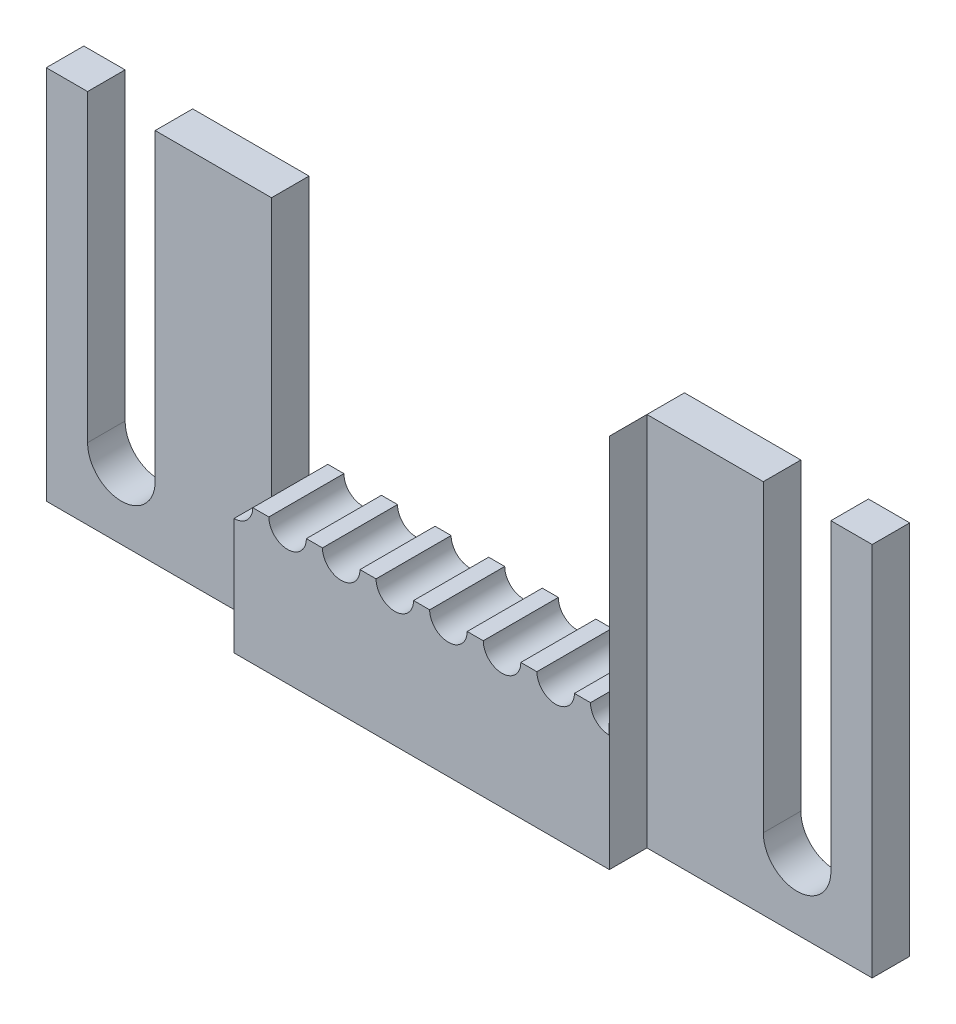
ISO-10303-21;
HEADER;
FILE_DESCRIPTION(('STEP AP214'),'2;1');
FILE_NAME('part.step','',(''),(''),'','','');
FILE_SCHEMA(('AUTOMOTIVE_DESIGN { 1 0 10303 214 1 1 1 1 }'));
ENDSEC;
DATA;
#1=APPLICATION_CONTEXT('core data for automotive mechanical design processes');
#2=APPLICATION_PROTOCOL_DEFINITION('international standard','automotive_design',2000,#1);
#3=PRODUCT_CONTEXT('',#1,'mechanical');
#4=PRODUCT('Part','Part','',(#3));
#5=PRODUCT_RELATED_PRODUCT_CATEGORY('part','',(#4));
#6=PRODUCT_DEFINITION_FORMATION('','',#4);
#7=PRODUCT_DEFINITION_CONTEXT('part definition',#1,'design');
#8=PRODUCT_DEFINITION('design','',#6,#7);
#9=PRODUCT_DEFINITION_SHAPE('','',#8);
#10=(LENGTH_UNIT() NAMED_UNIT(*) SI_UNIT(.MILLI.,.METRE.));
#11=(NAMED_UNIT(*) PLANE_ANGLE_UNIT() SI_UNIT($,.RADIAN.));
#12=(NAMED_UNIT(*) SI_UNIT($,.STERADIAN.) SOLID_ANGLE_UNIT());
#13=UNCERTAINTY_MEASURE_WITH_UNIT(LENGTH_MEASURE(1.E-05),#10,'distance_accuracy_value','');
#14=(GEOMETRIC_REPRESENTATION_CONTEXT(3) GLOBAL_UNCERTAINTY_ASSIGNED_CONTEXT((#13)) GLOBAL_UNIT_ASSIGNED_CONTEXT((#10,
#11,#12)) REPRESENTATION_CONTEXT('',''));
#15=CARTESIAN_POINT('',(0.,0.,0.));
#16=DIRECTION('',(0.,0.,1.));
#17=DIRECTION('',(1.,0.,0.));
#18=AXIS2_PLACEMENT_3D('',#15,#16,#17);
#19=CARTESIAN_POINT('',(-27.5,12.5,5.));
#20=DIRECTION('',(0.,-1.,0.));
#21=DIRECTION('',(0.,0.,-1.));
#22=AXIS2_PLACEMENT_3D('',#19,#20,#21);
#23=PLANE('',#22);
#24=DIRECTION('',(-1.,0.,0.));
#25=VECTOR('',#24,1.);
#26=CARTESIAN_POINT('',(0.,12.5,2.5));
#27=LINE('',#26,#25);
#28=CARTESIAN_POINT('',(20.25,12.5,2.5));
#29=VERTEX_POINT('',#28);
#30=CARTESIAN_POINT('',(12.5,12.5,2.5));
#31=VERTEX_POINT('',#30);
#32=EDGE_CURVE('E807',#29,#31,#27,.T.);
#33=ORIENTED_EDGE('',*,*,#32,.F.);
#34=DIRECTION('',(0.,0.,-1.));
#35=VECTOR('',#34,1.);
#36=CARTESIAN_POINT('',(20.25,12.5,5.));
#37=LINE('',#36,#35);
#38=CARTESIAN_POINT('',(20.25,12.5,0.));
#39=VERTEX_POINT('',#38);
#40=EDGE_CURVE('E13',#29,#39,#37,.T.);
#41=ORIENTED_EDGE('',*,*,#40,.T.);
#42=DIRECTION('',(-1.,0.,0.));
#43=VECTOR('',#42,1.);
#44=CARTESIAN_POINT('',(-27.5,12.5,0.));
#45=LINE('',#44,#43);
#46=CARTESIAN_POINT('',(12.5,12.5,0.));
#47=VERTEX_POINT('',#46);
#48=EDGE_CURVE('E901',#39,#47,#45,.T.);
#49=ORIENTED_EDGE('',*,*,#48,.T.);
#50=DIRECTION('',(0.,0.,1.));
#51=VECTOR('',#50,1.);
#52=CARTESIAN_POINT('',(12.5,12.5,-5.));
#53=LINE('',#52,#51);
#54=EDGE_CURVE('E837',#47,#31,#53,.T.);
#55=ORIENTED_EDGE('',*,*,#54,.T.);
#56=EDGE_LOOP('',(#33,#41,#49,#55));
#57=FACE_BOUND('',#56,.T.);
#58=ADVANCED_FACE('F523',(#57),#23,.F.);
#59=DIRECTION('',(-1.,0.,0.));
#60=VECTOR('',#59,1.);
#61=CARTESIAN_POINT('',(0.,12.5,2.5));
#62=LINE('',#61,#60);
#63=CARTESIAN_POINT('',(-24.75,12.5,2.5));
#64=VERTEX_POINT('',#63);
#65=CARTESIAN_POINT('',(-27.5,12.5,2.5));
#66=VERTEX_POINT('',#65);
#67=EDGE_CURVE('E790',#64,#66,#62,.T.);
#68=ORIENTED_EDGE('',*,*,#67,.F.);
#69=DIRECTION('',(0.,0.,-1.));
#70=VECTOR('',#69,1.);
#71=CARTESIAN_POINT('',(-24.75,12.5,5.));
#72=LINE('',#71,#70);
#73=CARTESIAN_POINT('',(-24.75,12.5,0.));
#74=VERTEX_POINT('',#73);
#75=EDGE_CURVE('E969',#64,#74,#72,.T.);
#76=ORIENTED_EDGE('',*,*,#75,.T.);
#77=CARTESIAN_POINT('',(-27.5,12.5,0.));
#78=VERTEX_POINT('',#77);
#79=EDGE_CURVE('E897',#74,#78,#45,.T.);
#80=ORIENTED_EDGE('',*,*,#79,.T.);
#81=DIRECTION('',(0.,0.,-1.));
#82=VECTOR('',#81,1.);
#83=CARTESIAN_POINT('',(-27.5,12.5,5.));
#84=LINE('',#83,#82);
#85=EDGE_CURVE('E910',#66,#78,#84,.T.);
#86=ORIENTED_EDGE('',*,*,#85,.F.);
#87=EDGE_LOOP('',(#68,#76,#80,#86));
#88=FACE_BOUND('',#87,.T.);
#89=ADVANCED_FACE('F998',(#88),#23,.F.);
#90=CARTESIAN_POINT('',(-12.5,12.5,0.));
#91=VERTEX_POINT('',#90);
#92=CARTESIAN_POINT('',(-20.25,12.5,0.));
#93=VERTEX_POINT('',#92);
#94=EDGE_CURVE('E902',#91,#93,#45,.T.);
#95=ORIENTED_EDGE('',*,*,#94,.T.);
#96=DIRECTION('',(0.,0.,1.));
#97=VECTOR('',#96,1.);
#98=CARTESIAN_POINT('',(-20.25,12.5,5.));
#99=LINE('',#98,#97);
#100=CARTESIAN_POINT('',(-20.25,12.5,2.5));
#101=VERTEX_POINT('',#100);
#102=EDGE_CURVE('E967',#93,#101,#99,.T.);
#103=ORIENTED_EDGE('',*,*,#102,.T.);
#104=CARTESIAN_POINT('',(-12.5,12.5,2.5));
#105=VERTEX_POINT('',#104);
#106=EDGE_CURVE('E791',#105,#101,#62,.T.);
#107=ORIENTED_EDGE('',*,*,#106,.F.);
#108=DIRECTION('',(0.,0.,1.));
#109=VECTOR('',#108,1.);
#110=CARTESIAN_POINT('',(-12.5,12.5,-5.));
#111=LINE('',#110,#109);
#112=EDGE_CURVE('E873',#91,#105,#111,.T.);
#113=ORIENTED_EDGE('',*,*,#112,.F.);
#114=EDGE_LOOP('',(#95,#103,#107,#113));
#115=FACE_BOUND('',#114,.T.);
#116=ADVANCED_FACE('F1046',(#115),#23,.F.);
#117=CARTESIAN_POINT('',(-27.5,12.5,5.));
#118=DIRECTION('',(1.,0.,0.));
#119=DIRECTION('',(0.,0.,-1.));
#120=AXIS2_PLACEMENT_3D('',#117,#118,#119);
#121=PLANE('',#120);
#122=DIRECTION('',(0.,-1.,0.));
#123=VECTOR('',#122,1.);
#124=CARTESIAN_POINT('',(-27.5,0.,2.5));
#125=LINE('',#124,#123);
#126=CARTESIAN_POINT('',(-27.5,-12.5,2.5));
#127=VERTEX_POINT('',#126);
#128=EDGE_CURVE('E794',#66,#127,#125,.T.);
#129=ORIENTED_EDGE('',*,*,#128,.F.);
#130=ORIENTED_EDGE('',*,*,#85,.T.);
#131=DIRECTION('',(0.,-1.,0.));
#132=VECTOR('',#131,1.);
#133=CARTESIAN_POINT('',(-27.5,12.5,0.));
#134=LINE('',#133,#132);
#135=CARTESIAN_POINT('',(-27.5,-12.5,0.));
#136=VERTEX_POINT('',#135);
#137=EDGE_CURVE('E900',#78,#136,#134,.T.);
#138=ORIENTED_EDGE('',*,*,#137,.T.);
#139=DIRECTION('',(0.,0.,-1.));
#140=VECTOR('',#139,1.);
#141=CARTESIAN_POINT('',(-27.5,-12.5,5.));
#142=LINE('',#141,#140);
#143=EDGE_CURVE('E908',#127,#136,#142,.T.);
#144=ORIENTED_EDGE('',*,*,#143,.F.);
#145=EDGE_LOOP('',(#129,#130,#138,#144));
#146=FACE_BOUND('',#145,.T.);
#147=ADVANCED_FACE('F994',(#146),#121,.F.);
#148=CARTESIAN_POINT('',(-12.5,0.,-5.));
#149=DIRECTION('',(-1.,0.,0.));
#150=DIRECTION('',(0.,-1.,0.));
#151=AXIS2_PLACEMENT_3D('',#148,#149,#150);
#152=PLANE('',#151);
#153=DIRECTION('',(0.,1.,0.));
#154=VECTOR('',#153,1.);
#155=CARTESIAN_POINT('',(-12.5,0.,2.5));
#156=LINE('',#155,#154);
#157=CARTESIAN_POINT('',(-12.5,-4.74999999999999,2.5));
#158=VERTEX_POINT('',#157);
#159=EDGE_CURVE('E965',#158,#105,#156,.T.);
#160=ORIENTED_EDGE('',*,*,#159,.F.);
#161=DIRECTION('',(0.,0.,1.));
#162=VECTOR('',#161,1.);
#163=CARTESIAN_POINT('',(-12.5,-4.74999999999999,-5.));
#164=LINE('',#163,#162);
#165=CARTESIAN_POINT('',(-12.5,-4.74999999999999,0.));
#166=VERTEX_POINT('',#165);
#167=EDGE_CURVE('E869',#166,#158,#164,.T.);
#168=ORIENTED_EDGE('',*,*,#167,.F.);
#169=DIRECTION('',(0.,-1.,0.));
#170=VECTOR('',#169,1.);
#171=CARTESIAN_POINT('',(-12.5,0.,0.));
#172=LINE('',#171,#170);
#173=EDGE_CURVE('E951',#91,#166,#172,.T.);
#174=ORIENTED_EDGE('',*,*,#173,.F.);
#175=ORIENTED_EDGE('',*,*,#112,.T.);
#176=EDGE_LOOP('',(#160,#168,#174,#175));
#177=FACE_BOUND('',#176,.T.);
#178=ADVANCED_FACE('F1040',(#177),#152,.F.);
#179=CARTESIAN_POINT('',(27.5,12.5,0.));
#180=VERTEX_POINT('',#179);
#181=CARTESIAN_POINT('',(24.75,12.5,0.));
#182=VERTEX_POINT('',#181);
#183=EDGE_CURVE('E898',#180,#182,#45,.T.);
#184=ORIENTED_EDGE('',*,*,#183,.T.);
#185=DIRECTION('',(0.,0.,1.));
#186=VECTOR('',#185,1.);
#187=CARTESIAN_POINT('',(24.75,12.5,5.));
#188=LINE('',#187,#186);
#189=CARTESIAN_POINT('',(24.75,12.5,2.5));
#190=VERTEX_POINT('',#189);
#191=EDGE_CURVE('E531',#182,#190,#188,.T.);
#192=ORIENTED_EDGE('',*,*,#191,.T.);
#193=CARTESIAN_POINT('',(27.5,12.5,2.5));
#194=VERTEX_POINT('',#193);
#195=EDGE_CURVE('E808',#194,#190,#27,.T.);
#196=ORIENTED_EDGE('',*,*,#195,.F.);
#197=DIRECTION('',(0.,0.,-1.));
#198=VECTOR('',#197,1.);
#199=CARTESIAN_POINT('',(27.5,12.5,5.));
#200=LINE('',#199,#198);
#201=EDGE_CURVE('E913',#194,#180,#200,.T.);
#202=ORIENTED_EDGE('',*,*,#201,.T.);
#203=EDGE_LOOP('',(#184,#192,#196,#202));
#204=FACE_BOUND('',#203,.T.);
#205=ADVANCED_FACE('F973',(#204),#23,.F.);
#206=CARTESIAN_POINT('',(0.,0.,5.));
#207=DIRECTION('',(0.,0.,1.));
#208=DIRECTION('',(1.,0.,0.));
#209=AXIS2_PLACEMENT_3D('',#206,#207,#208);
#210=PLANE('',#209);
#211=DIRECTION('',(0.,1.,0.));
#212=VECTOR('',#211,1.);
#213=CARTESIAN_POINT('',(-12.5,0.,5.));
#214=LINE('',#213,#212);
#215=CARTESIAN_POINT('',(-12.5,-12.5,5.));
#216=VERTEX_POINT('',#215);
#217=CARTESIAN_POINT('',(-12.5,-4.74999999999999,5.));
#218=VERTEX_POINT('',#217);
#219=EDGE_CURVE('E784',#216,#218,#214,.T.);
#220=ORIENTED_EDGE('',*,*,#219,.F.);
#221=DIRECTION('',(1.,0.,0.));
#222=VECTOR('',#221,1.);
#223=CARTESIAN_POINT('',(-27.5,-12.5,5.));
#224=LINE('',#223,#222);
#225=CARTESIAN_POINT('',(12.5,-12.5,5.));
#226=VERTEX_POINT('',#225);
#227=EDGE_CURVE('E891',#216,#226,#224,.T.);
#228=ORIENTED_EDGE('',*,*,#227,.T.);
#229=DIRECTION('',(0.,1.,0.));
#230=VECTOR('',#229,1.);
#231=CARTESIAN_POINT('',(12.5,0.,5.));
#232=LINE('',#231,#230);
#233=CARTESIAN_POINT('',(12.5,12.5,5.));
#234=VERTEX_POINT('',#233);
#235=EDGE_CURVE('E799',#226,#234,#232,.T.);
#236=ORIENTED_EDGE('',*,*,#235,.T.);
#237=DIRECTION('',(-0.000579710047518429,-0.999999831968116,0.));
#238=VECTOR('',#237,1.);
#239=CARTESIAN_POINT('',(12.4927494248269,-0.0072421735796183,5.));
#240=LINE('',#239,#238);
#241=CARTESIAN_POINT('',(12.49,-4.74999999999999,5.));
#242=VERTEX_POINT('',#241);
#243=EDGE_CURVE('E819',#234,#242,#240,.T.);
#244=ORIENTED_EDGE('',*,*,#243,.T.);
#245=CARTESIAN_POINT('',(12.49,-3.49999999999999,5.));
#246=DIRECTION('',(0.,0.,1.));
#247=DIRECTION('',(1.,0.,0.));
#248=AXIS2_PLACEMENT_3D('',#245,#246,#247);
#249=CIRCLE('',#248,1.25);
#250=CARTESIAN_POINT('',(11.24,-3.49999999999999,5.));
#251=VERTEX_POINT('',#250);
#252=EDGE_CURVE('E834',#251,#242,#249,.T.);
#253=ORIENTED_EDGE('',*,*,#252,.F.);
#254=DIRECTION('',(1.,0.,0.));
#255=VECTOR('',#254,1.);
#256=CARTESIAN_POINT('',(0.,-3.49999999999999,5.));
#257=LINE('',#256,#255);
#258=CARTESIAN_POINT('',(10.17,-3.49999999999999,5.));
#259=VERTEX_POINT('',#258);
#260=EDGE_CURVE('E830',#259,#251,#257,.T.);
#261=ORIENTED_EDGE('',*,*,#260,.F.);
#262=CARTESIAN_POINT('',(8.91999999999999,-3.49999999999999,5.));
#263=DIRECTION('',(0.,0.,1.));
#264=DIRECTION('',(1.,0.,0.));
#265=AXIS2_PLACEMENT_3D('',#262,#263,#264);
#266=CIRCLE('',#265,1.25);
#267=CARTESIAN_POINT('',(7.66999999999999,-3.49999999999999,5.));
#268=VERTEX_POINT('',#267);
#269=EDGE_CURVE('E816',#268,#259,#266,.T.);
#270=ORIENTED_EDGE('',*,*,#269,.F.);
#271=CARTESIAN_POINT('',(6.59999999999999,-3.49999999999999,5.));
#272=VERTEX_POINT('',#271);
#273=EDGE_CURVE('E1020',#272,#268,#257,.T.);
#274=ORIENTED_EDGE('',*,*,#273,.F.);
#275=CARTESIAN_POINT('',(5.34999999999999,-3.49999999999999,5.));
#276=DIRECTION('',(0.,0.,1.));
#277=DIRECTION('',(1.,0.,0.));
#278=AXIS2_PLACEMENT_3D('',#275,#276,#277);
#279=CIRCLE('',#278,1.25);
#280=CARTESIAN_POINT('',(4.09999999999999,-3.49999999999999,5.));
#281=VERTEX_POINT('',#280);
#282=EDGE_CURVE('E886',#281,#272,#279,.T.);
#283=ORIENTED_EDGE('',*,*,#282,.F.);
#284=CARTESIAN_POINT('',(3.02999999999999,-3.49999999999999,5.));
#285=VERTEX_POINT('',#284);
#286=EDGE_CURVE('E1391',#285,#281,#257,.T.);
#287=ORIENTED_EDGE('',*,*,#286,.F.);
#288=CARTESIAN_POINT('',(1.77999999999999,-3.49999999999999,5.));
#289=DIRECTION('',(0.,0.,1.));
#290=DIRECTION('',(1.,0.,0.));
#291=AXIS2_PLACEMENT_3D('',#288,#289,#290);
#292=CIRCLE('',#291,1.25);
#293=CARTESIAN_POINT('',(0.529999999999994,-3.49999999999999,5.));
#294=VERTEX_POINT('',#293);
#295=EDGE_CURVE('E883',#294,#285,#292,.T.);
#296=ORIENTED_EDGE('',*,*,#295,.F.);
#297=CARTESIAN_POINT('',(-0.540000000000004,-3.49999999999999,5.));
#298=VERTEX_POINT('',#297);
#299=EDGE_CURVE('E1387',#298,#294,#257,.T.);
#300=ORIENTED_EDGE('',*,*,#299,.F.);
#301=CARTESIAN_POINT('',(-1.79000000000001,-3.49999999999999,5.));
#302=DIRECTION('',(0.,0.,1.));
#303=DIRECTION('',(1.,0.,0.));
#304=AXIS2_PLACEMENT_3D('',#301,#302,#303);
#305=CIRCLE('',#304,1.25);
#306=CARTESIAN_POINT('',(-3.04000000000001,-3.49999999999999,5.));
#307=VERTEX_POINT('',#306);
#308=EDGE_CURVE('E880',#307,#298,#305,.T.);
#309=ORIENTED_EDGE('',*,*,#308,.F.);
#310=CARTESIAN_POINT('',(-4.11,-3.49999999999999,5.));
#311=VERTEX_POINT('',#310);
#312=EDGE_CURVE('E1385',#311,#307,#257,.T.);
#313=ORIENTED_EDGE('',*,*,#312,.F.);
#314=CARTESIAN_POINT('',(-5.36,-3.49999999999999,5.));
#315=DIRECTION('',(0.,0.,1.));
#316=DIRECTION('',(1.,0.,0.));
#317=AXIS2_PLACEMENT_3D('',#314,#315,#316);
#318=CIRCLE('',#317,1.25);
#319=CARTESIAN_POINT('',(-6.61,-3.49999999999999,5.));
#320=VERTEX_POINT('',#319);
#321=EDGE_CURVE('E823',#320,#311,#318,.T.);
#322=ORIENTED_EDGE('',*,*,#321,.F.);
#323=CARTESIAN_POINT('',(-7.68,-3.49999999999999,5.));
#324=VERTEX_POINT('',#323);
#325=EDGE_CURVE('E831',#324,#320,#257,.T.);
#326=ORIENTED_EDGE('',*,*,#325,.F.);
#327=CARTESIAN_POINT('',(-8.93,-3.49999999999999,5.));
#328=DIRECTION('',(0.,0.,1.));
#329=DIRECTION('',(1.,0.,0.));
#330=AXIS2_PLACEMENT_3D('',#327,#328,#329);
#331=CIRCLE('',#330,1.25);
#332=CARTESIAN_POINT('',(-10.18,-3.49999999999999,5.));
#333=VERTEX_POINT('',#332);
#334=EDGE_CURVE('E829',#333,#324,#331,.T.);
#335=ORIENTED_EDGE('',*,*,#334,.F.);
#336=CARTESIAN_POINT('',(-11.25,-3.49999999999999,5.));
#337=VERTEX_POINT('',#336);
#338=EDGE_CURVE('E826',#337,#333,#257,.T.);
#339=ORIENTED_EDGE('',*,*,#338,.F.);
#340=CARTESIAN_POINT('',(-12.5,-3.49999999999999,5.));
#341=DIRECTION('',(0.,0.,1.));
#342=DIRECTION('',(1.,0.,0.));
#343=AXIS2_PLACEMENT_3D('',#340,#341,#342);
#344=CIRCLE('',#343,1.25);
#345=EDGE_CURVE('E822',#218,#337,#344,.T.);
#346=ORIENTED_EDGE('',*,*,#345,.F.);
#347=EDGE_LOOP('',(#220,#228,#236,#244,#253,#261,#270,#274,#283,#287,#296,#300,#309,#313,#322,
#326,#335,#339,#346));
#348=FACE_BOUND('',#347,.T.);
#349=ADVANCED_FACE('F1022',(#348),#210,.T.);
#350=CARTESIAN_POINT('',(27.5,12.5,5.));
#351=DIRECTION('',(-1.,0.,0.));
#352=DIRECTION('',(0.,-1.,0.));
#353=AXIS2_PLACEMENT_3D('',#350,#351,#352);
#354=PLANE('',#353);
#355=DIRECTION('',(0.,1.,0.));
#356=VECTOR('',#355,1.);
#357=CARTESIAN_POINT('',(27.5,0.,2.5));
#358=LINE('',#357,#356);
#359=CARTESIAN_POINT('',(27.5,-12.5,2.5));
#360=VERTEX_POINT('',#359);
#361=EDGE_CURVE('E805',#360,#194,#358,.T.);
#362=ORIENTED_EDGE('',*,*,#361,.F.);
#363=DIRECTION('',(0.,0.,-1.));
#364=VECTOR('',#363,1.);
#365=CARTESIAN_POINT('',(27.5,-12.5,5.));
#366=LINE('',#365,#364);
#367=CARTESIAN_POINT('',(27.5,-12.5,0.));
#368=VERTEX_POINT('',#367);
#369=EDGE_CURVE('E893',#360,#368,#366,.T.);
#370=ORIENTED_EDGE('',*,*,#369,.T.);
#371=DIRECTION('',(0.,1.,0.));
#372=VECTOR('',#371,1.);
#373=CARTESIAN_POINT('',(27.5,12.5,0.));
#374=LINE('',#373,#372);
#375=EDGE_CURVE('E840',#368,#180,#374,.T.);
#376=ORIENTED_EDGE('',*,*,#375,.T.);
#377=ORIENTED_EDGE('',*,*,#201,.F.);
#378=EDGE_LOOP('',(#362,#370,#376,#377));
#379=FACE_BOUND('',#378,.T.);
#380=ADVANCED_FACE('F525',(#379),#354,.F.);
#381=CARTESIAN_POINT('',(-27.5,-12.5,5.));
#382=DIRECTION('',(0.,1.,0.));
#383=DIRECTION('',(0.,0.,1.));
#384=AXIS2_PLACEMENT_3D('',#381,#382,#383);
#385=PLANE('',#384);
#386=ORIENTED_EDGE('',*,*,#227,.F.);
#387=DIRECTION('',(0.,0.,1.));
#388=VECTOR('',#387,1.);
#389=CARTESIAN_POINT('',(-12.5,-12.5,2.5));
#390=LINE('',#389,#388);
#391=CARTESIAN_POINT('',(-12.5,-12.5,2.5));
#392=VERTEX_POINT('',#391);
#393=EDGE_CURVE('E796',#392,#216,#390,.T.);
#394=ORIENTED_EDGE('',*,*,#393,.F.);
#395=DIRECTION('',(1.,0.,0.));
#396=VECTOR('',#395,1.);
#397=CARTESIAN_POINT('',(0.,-12.5,2.5));
#398=LINE('',#397,#396);
#399=EDGE_CURVE('E785',#127,#392,#398,.T.);
#400=ORIENTED_EDGE('',*,*,#399,.F.);
#401=ORIENTED_EDGE('',*,*,#143,.T.);
#402=DIRECTION('',(1.,0.,0.));
#403=VECTOR('',#402,1.);
#404=CARTESIAN_POINT('',(-27.5,-12.5,0.));
#405=LINE('',#404,#403);
#406=EDGE_CURVE('E894',#136,#368,#405,.T.);
#407=ORIENTED_EDGE('',*,*,#406,.T.);
#408=ORIENTED_EDGE('',*,*,#369,.F.);
#409=DIRECTION('',(1.,0.,0.));
#410=VECTOR('',#409,1.);
#411=CARTESIAN_POINT('',(0.,-12.5,2.5));
#412=LINE('',#411,#410);
#413=CARTESIAN_POINT('',(12.5,-12.5,2.5));
#414=VERTEX_POINT('',#413);
#415=EDGE_CURVE('E803',#414,#360,#412,.T.);
#416=ORIENTED_EDGE('',*,*,#415,.F.);
#417=DIRECTION('',(0.,0.,1.));
#418=VECTOR('',#417,1.);
#419=CARTESIAN_POINT('',(12.5,-12.5,2.5));
#420=LINE('',#419,#418);
#421=EDGE_CURVE('E811',#414,#226,#420,.T.);
#422=ORIENTED_EDGE('',*,*,#421,.T.);
#423=EDGE_LOOP('',(#386,#394,#400,#401,#407,#408,#416,#422));
#424=FACE_BOUND('',#423,.T.);
#425=ADVANCED_FACE('F984',(#424),#385,.F.);
#426=CARTESIAN_POINT('',(0.,0.,0.));
#427=DIRECTION('',(0.,0.,1.));
#428=DIRECTION('',(1.,0.,0.));
#429=AXIS2_PLACEMENT_3D('',#426,#427,#428);
#430=PLANE('',#429);
#431=ORIENTED_EDGE('',*,*,#48,.F.);
#432=DIRECTION('',(0.,1.,0.));
#433=VECTOR('',#432,1.);
#434=CARTESIAN_POINT('',(20.25,-7.75,0.));
#435=LINE('',#434,#433);
#436=CARTESIAN_POINT('',(20.25,-7.75,0.));
#437=VERTEX_POINT('',#436);
#438=EDGE_CURVE('E746',#437,#39,#435,.T.);
#439=ORIENTED_EDGE('',*,*,#438,.F.);
#440=CARTESIAN_POINT('',(22.5,-7.75,0.));
#441=DIRECTION('',(0.,0.,1.));
#442=DIRECTION('',(1.,0.,0.));
#443=AXIS2_PLACEMENT_3D('',#440,#441,#442);
#444=CIRCLE('',#443,2.24999999999999);
#445=CARTESIAN_POINT('',(24.75,-7.75,0.));
#446=VERTEX_POINT('',#445);
#447=EDGE_CURVE('E752',#437,#446,#444,.T.);
#448=ORIENTED_EDGE('',*,*,#447,.T.);
#449=DIRECTION('',(0.,1.,0.));
#450=VECTOR('',#449,1.);
#451=CARTESIAN_POINT('',(24.75,-7.75,0.));
#452=LINE('',#451,#450);
#453=EDGE_CURVE('E738',#446,#182,#452,.T.);
#454=ORIENTED_EDGE('',*,*,#453,.T.);
#455=ORIENTED_EDGE('',*,*,#183,.F.);
#456=ORIENTED_EDGE('',*,*,#375,.F.);
#457=ORIENTED_EDGE('',*,*,#406,.F.);
#458=ORIENTED_EDGE('',*,*,#137,.F.);
#459=ORIENTED_EDGE('',*,*,#79,.F.);
#460=DIRECTION('',(0.,1.,0.));
#461=VECTOR('',#460,1.);
#462=CARTESIAN_POINT('',(-24.75,-7.75,0.));
#463=LINE('',#462,#461);
#464=CARTESIAN_POINT('',(-24.75,-7.75,0.));
#465=VERTEX_POINT('',#464);
#466=EDGE_CURVE('E769',#465,#74,#463,.T.);
#467=ORIENTED_EDGE('',*,*,#466,.F.);
#468=CARTESIAN_POINT('',(-22.5,-7.75,0.));
#469=DIRECTION('',(0.,0.,1.));
#470=DIRECTION('',(1.,0.,0.));
#471=AXIS2_PLACEMENT_3D('',#468,#469,#470);
#472=CIRCLE('',#471,2.24999999999999);
#473=CARTESIAN_POINT('',(-20.25,-7.75,0.));
#474=VERTEX_POINT('',#473);
#475=EDGE_CURVE('E779',#465,#474,#472,.T.);
#476=ORIENTED_EDGE('',*,*,#475,.T.);
#477=DIRECTION('',(0.,1.,0.));
#478=VECTOR('',#477,1.);
#479=CARTESIAN_POINT('',(-20.25,-7.75,0.));
#480=LINE('',#479,#478);
#481=EDGE_CURVE('E766',#474,#93,#480,.T.);
#482=ORIENTED_EDGE('',*,*,#481,.T.);
#483=ORIENTED_EDGE('',*,*,#94,.F.);
#484=ORIENTED_EDGE('',*,*,#173,.T.);
#485=CARTESIAN_POINT('',(-12.5,-3.49999999999999,0.));
#486=DIRECTION('',(0.,0.,1.));
#487=DIRECTION('',(1.,0.,0.));
#488=AXIS2_PLACEMENT_3D('',#485,#486,#487);
#489=CIRCLE('',#488,1.25);
#490=CARTESIAN_POINT('',(-11.25,-3.49999999999999,0.));
#491=VERTEX_POINT('',#490);
#492=EDGE_CURVE('E942',#166,#491,#489,.T.);
#493=ORIENTED_EDGE('',*,*,#492,.T.);
#494=DIRECTION('',(1.,0.,0.));
#495=VECTOR('',#494,1.);
#496=CARTESIAN_POINT('',(0.,-3.49999999999999,0.));
#497=LINE('',#496,#495);
#498=CARTESIAN_POINT('',(-10.18,-3.49999999999999,0.));
#499=VERTEX_POINT('',#498);
#500=EDGE_CURVE('E933',#491,#499,#497,.T.);
#501=ORIENTED_EDGE('',*,*,#500,.T.);
#502=CARTESIAN_POINT('',(-8.93,-3.49999999999999,0.));
#503=DIRECTION('',(0.,0.,1.));
#504=DIRECTION('',(1.,0.,0.));
#505=AXIS2_PLACEMENT_3D('',#502,#503,#504);
#506=CIRCLE('',#505,1.25);
#507=CARTESIAN_POINT('',(-7.68,-3.49999999999999,0.));
#508=VERTEX_POINT('',#507);
#509=EDGE_CURVE('E924',#499,#508,#506,.T.);
#510=ORIENTED_EDGE('',*,*,#509,.T.);
#511=DIRECTION('',(1.,0.,0.));
#512=VECTOR('',#511,1.);
#513=CARTESIAN_POINT('',(0.,-3.49999999999999,0.));
#514=LINE('',#513,#512);
#515=CARTESIAN_POINT('',(-6.61,-3.49999999999999,0.));
#516=VERTEX_POINT('',#515);
#517=EDGE_CURVE('E918',#508,#516,#514,.T.);
#518=ORIENTED_EDGE('',*,*,#517,.T.);
#519=CARTESIAN_POINT('',(-5.36,-3.49999999999999,0.));
#520=DIRECTION('',(0.,0.,1.));
#521=DIRECTION('',(1.,0.,0.));
#522=AXIS2_PLACEMENT_3D('',#519,#520,#521);
#523=CIRCLE('',#522,1.25);
#524=CARTESIAN_POINT('',(-4.11,-3.49999999999999,0.));
#525=VERTEX_POINT('',#524);
#526=EDGE_CURVE('E915',#516,#525,#523,.T.);
#527=ORIENTED_EDGE('',*,*,#526,.T.);
#528=DIRECTION('',(1.,0.,0.));
#529=VECTOR('',#528,1.);
#530=CARTESIAN_POINT('',(0.,-3.49999999999999,0.));
#531=LINE('',#530,#529);
#532=CARTESIAN_POINT('',(-3.04000000000001,-3.49999999999999,0.));
#533=VERTEX_POINT('',#532);
#534=EDGE_CURVE('E921',#525,#533,#531,.T.);
#535=ORIENTED_EDGE('',*,*,#534,.T.);
#536=CARTESIAN_POINT('',(-1.79000000000001,-3.49999999999999,0.));
#537=DIRECTION('',(0.,0.,1.));
#538=DIRECTION('',(1.,0.,0.));
#539=AXIS2_PLACEMENT_3D('',#536,#537,#538);
#540=CIRCLE('',#539,1.25);
#541=CARTESIAN_POINT('',(-0.540000000000004,-3.49999999999999,0.));
#542=VERTEX_POINT('',#541);
#543=EDGE_CURVE('E927',#533,#542,#540,.T.);
#544=ORIENTED_EDGE('',*,*,#543,.T.);
#545=DIRECTION('',(1.,0.,0.));
#546=VECTOR('',#545,1.);
#547=CARTESIAN_POINT('',(0.,-3.49999999999999,0.));
#548=LINE('',#547,#546);
#549=CARTESIAN_POINT('',(0.529999999999994,-3.49999999999999,0.));
#550=VERTEX_POINT('',#549);
#551=EDGE_CURVE('E930',#542,#550,#548,.T.);
#552=ORIENTED_EDGE('',*,*,#551,.T.);
#553=CARTESIAN_POINT('',(1.77999999999999,-3.49999999999999,0.));
#554=DIRECTION('',(0.,0.,1.));
#555=DIRECTION('',(1.,0.,0.));
#556=AXIS2_PLACEMENT_3D('',#553,#554,#555);
#557=CIRCLE('',#556,1.25);
#558=CARTESIAN_POINT('',(3.02999999999999,-3.49999999999999,0.));
#559=VERTEX_POINT('',#558);
#560=EDGE_CURVE('E936',#550,#559,#557,.T.);
#561=ORIENTED_EDGE('',*,*,#560,.T.);
#562=DIRECTION('',(1.,0.,0.));
#563=VECTOR('',#562,1.);
#564=CARTESIAN_POINT('',(0.,-3.49999999999999,0.));
#565=LINE('',#564,#563);
#566=CARTESIAN_POINT('',(4.09999999999999,-3.49999999999999,0.));
#567=VERTEX_POINT('',#566);
#568=EDGE_CURVE('E939',#559,#567,#565,.T.);
#569=ORIENTED_EDGE('',*,*,#568,.T.);
#570=CARTESIAN_POINT('',(5.34999999999999,-3.49999999999999,0.));
#571=DIRECTION('',(0.,0.,1.));
#572=DIRECTION('',(1.,0.,0.));
#573=AXIS2_PLACEMENT_3D('',#570,#571,#572);
#574=CIRCLE('',#573,1.25);
#575=CARTESIAN_POINT('',(6.59999999999999,-3.49999999999999,0.));
#576=VERTEX_POINT('',#575);
#577=EDGE_CURVE('E945',#567,#576,#574,.T.);
#578=ORIENTED_EDGE('',*,*,#577,.T.);
#579=DIRECTION('',(1.,0.,0.));
#580=VECTOR('',#579,1.);
#581=CARTESIAN_POINT('',(0.,-3.49999999999999,0.));
#582=LINE('',#581,#580);
#583=CARTESIAN_POINT('',(7.66999999999999,-3.49999999999999,0.));
#584=VERTEX_POINT('',#583);
#585=EDGE_CURVE('E948',#576,#584,#582,.T.);
#586=ORIENTED_EDGE('',*,*,#585,.T.);
#587=CARTESIAN_POINT('',(8.91999999999999,-3.49999999999999,0.));
#588=DIRECTION('',(0.,0.,1.));
#589=DIRECTION('',(1.,0.,0.));
#590=AXIS2_PLACEMENT_3D('',#587,#588,#589);
#591=CIRCLE('',#590,1.25);
#592=CARTESIAN_POINT('',(10.17,-3.49999999999999,0.));
#593=VERTEX_POINT('',#592);
#594=EDGE_CURVE('E954',#584,#593,#591,.T.);
#595=ORIENTED_EDGE('',*,*,#594,.T.);
#596=DIRECTION('',(1.,0.,0.));
#597=VECTOR('',#596,1.);
#598=CARTESIAN_POINT('',(0.,-3.49999999999999,0.));
#599=LINE('',#598,#597);
#600=CARTESIAN_POINT('',(11.24,-3.49999999999999,0.));
#601=VERTEX_POINT('',#600);
#602=EDGE_CURVE('E957',#593,#601,#599,.T.);
#603=ORIENTED_EDGE('',*,*,#602,.T.);
#604=CARTESIAN_POINT('',(12.49,-3.49999999999999,0.));
#605=DIRECTION('',(0.,0.,1.));
#606=DIRECTION('',(1.,0.,0.));
#607=AXIS2_PLACEMENT_3D('',#604,#605,#606);
#608=CIRCLE('',#607,1.25);
#609=CARTESIAN_POINT('',(12.49,-4.74999999999999,0.));
#610=VERTEX_POINT('',#609);
#611=EDGE_CURVE('E960',#601,#610,#608,.T.);
#612=ORIENTED_EDGE('',*,*,#611,.T.);
#613=DIRECTION('',(-0.000579710047518429,-0.999999831968116,0.));
#614=VECTOR('',#613,1.);
#615=CARTESIAN_POINT('',(12.4927494248269,-0.0072421735796183,0.));
#616=LINE('',#615,#614);
#617=EDGE_CURVE('E963',#47,#610,#616,.T.);
#618=ORIENTED_EDGE('',*,*,#617,.F.);
#619=EDGE_LOOP('',(#431,#439,#448,#454,#455,#456,#457,#458,#459,#467,#476,#482,#483,#484,#493,
#501,#510,#518,#527,#535,#544,#552,#561,#569,#578,#586,#595,#603,#612,#618));
#620=FACE_BOUND('',#619,.T.);
#621=ADVANCED_FACE('F759',(#620),#430,.F.);
#622=CARTESIAN_POINT('',(-8.93,-3.49999999999999,-5.));
#623=DIRECTION('',(0.,0.,1.));
#624=DIRECTION('',(1.,0.,0.));
#625=AXIS2_PLACEMENT_3D('',#622,#623,#624);
#626=CYLINDRICAL_SURFACE('',#625,1.25);
#627=DIRECTION('',(0.,0.,1.));
#628=VECTOR('',#627,1.);
#629=CARTESIAN_POINT('',(-10.18,-3.49999999999999,-5.));
#630=LINE('',#629,#628);
#631=EDGE_CURVE('E865',#499,#333,#630,.T.);
#632=ORIENTED_EDGE('',*,*,#631,.T.);
#633=ORIENTED_EDGE('',*,*,#334,.T.);
#634=DIRECTION('',(0.,0.,1.));
#635=VECTOR('',#634,1.);
#636=CARTESIAN_POINT('',(-7.68,-3.49999999999999,-5.));
#637=LINE('',#636,#635);
#638=EDGE_CURVE('E863',#508,#324,#637,.T.);
#639=ORIENTED_EDGE('',*,*,#638,.F.);
#640=ORIENTED_EDGE('',*,*,#509,.F.);
#641=EDGE_LOOP('',(#632,#633,#639,#640));
#642=FACE_BOUND('',#641,.T.);
#643=ADVANCED_FACE('F1111',(#642),#626,.F.);
#644=CARTESIAN_POINT('',(0.,-3.49999999999999,-5.));
#645=DIRECTION('',(0.,-1.,0.));
#646=DIRECTION('',(0.,0.,-1.));
#647=AXIS2_PLACEMENT_3D('',#644,#645,#646);
#648=PLANE('',#647);
#649=DIRECTION('',(0.,0.,1.));
#650=VECTOR('',#649,1.);
#651=CARTESIAN_POINT('',(-11.25,-3.49999999999999,-5.));
#652=LINE('',#651,#650);
#653=EDGE_CURVE('E867',#491,#337,#652,.T.);
#654=ORIENTED_EDGE('',*,*,#653,.T.);
#655=ORIENTED_EDGE('',*,*,#338,.T.);
#656=ORIENTED_EDGE('',*,*,#631,.F.);
#657=ORIENTED_EDGE('',*,*,#500,.F.);
#658=EDGE_LOOP('',(#654,#655,#656,#657));
#659=FACE_BOUND('',#658,.T.);
#660=ADVANCED_FACE('F1179',(#659),#648,.F.);
#661=CARTESIAN_POINT('',(-12.5,-3.49999999999999,-5.));
#662=DIRECTION('',(0.,0.,1.));
#663=DIRECTION('',(1.,0.,0.));
#664=AXIS2_PLACEMENT_3D('',#661,#662,#663);
#665=CYLINDRICAL_SURFACE('',#664,1.25);
#666=ORIENTED_EDGE('',*,*,#167,.T.);
#667=EDGE_CURVE('E872',#158,#218,#164,.T.);
#668=ORIENTED_EDGE('',*,*,#667,.T.);
#669=ORIENTED_EDGE('',*,*,#345,.T.);
#670=ORIENTED_EDGE('',*,*,#653,.F.);
#671=ORIENTED_EDGE('',*,*,#492,.F.);
#672=EDGE_LOOP('',(#666,#668,#669,#670,#671));
#673=FACE_BOUND('',#672,.T.);
#674=ADVANCED_FACE('F1036',(#673),#665,.F.);
#675=CARTESIAN_POINT('',(12.4927494248269,-0.0072421735796183,-5.));
#676=DIRECTION('',(-0.999999831968116,0.000579710047518429,0.));
#677=DIRECTION('',(-0.000579710047518429,-0.999999831968116,0.));
#678=AXIS2_PLACEMENT_3D('',#675,#676,#677);
#679=PLANE('',#678);
#680=ORIENTED_EDGE('',*,*,#617,.T.);
#681=DIRECTION('',(0.,0.,1.));
#682=VECTOR('',#681,1.);
#683=CARTESIAN_POINT('',(12.49,-4.74999999999999,-5.));
#684=LINE('',#683,#682);
#685=EDGE_CURVE('E838',#610,#242,#684,.T.);
#686=ORIENTED_EDGE('',*,*,#685,.T.);
#687=ORIENTED_EDGE('',*,*,#243,.F.);
#688=DIRECTION('',(0.,0.,1.));
#689=VECTOR('',#688,1.);
#690=CARTESIAN_POINT('',(12.5,12.5,2.5));
#691=LINE('',#690,#689);
#692=EDGE_CURVE('E814',#31,#234,#691,.T.);
#693=ORIENTED_EDGE('',*,*,#692,.F.);
#694=ORIENTED_EDGE('',*,*,#54,.F.);
#695=EDGE_LOOP('',(#680,#686,#687,#693,#694));
#696=FACE_BOUND('',#695,.T.);
#697=ADVANCED_FACE('F1006',(#696),#679,.T.);
#698=CARTESIAN_POINT('',(12.49,-3.49999999999999,-5.));
#699=DIRECTION('',(0.,0.,1.));
#700=DIRECTION('',(1.,0.,0.));
#701=AXIS2_PLACEMENT_3D('',#698,#699,#700);
#702=CYLINDRICAL_SURFACE('',#701,1.25);
#703=DIRECTION('',(0.,0.,1.));
#704=VECTOR('',#703,1.);
#705=CARTESIAN_POINT('',(11.24,-3.49999999999999,-5.));
#706=LINE('',#705,#704);
#707=EDGE_CURVE('E841',#601,#251,#706,.T.);
#708=ORIENTED_EDGE('',*,*,#707,.T.);
#709=ORIENTED_EDGE('',*,*,#252,.T.);
#710=ORIENTED_EDGE('',*,*,#685,.F.);
#711=ORIENTED_EDGE('',*,*,#611,.F.);
#712=EDGE_LOOP('',(#708,#709,#710,#711));
#713=FACE_BOUND('',#712,.T.);
#714=ADVANCED_FACE('F1011',(#713),#702,.F.);
#715=DIRECTION('',(0.,0.,1.));
#716=VECTOR('',#715,1.);
#717=CARTESIAN_POINT('',(10.17,-3.49999999999999,-5.));
#718=LINE('',#717,#716);
#719=EDGE_CURVE('E843',#593,#259,#718,.T.);
#720=ORIENTED_EDGE('',*,*,#719,.T.);
#721=ORIENTED_EDGE('',*,*,#260,.T.);
#722=ORIENTED_EDGE('',*,*,#707,.F.);
#723=ORIENTED_EDGE('',*,*,#602,.F.);
#724=EDGE_LOOP('',(#720,#721,#722,#723));
#725=FACE_BOUND('',#724,.T.);
#726=ADVANCED_FACE('F1014',(#725),#648,.F.);
#727=DIRECTION('',(0.,0.,1.));
#728=VECTOR('',#727,1.);
#729=CARTESIAN_POINT('',(6.59999999999999,-3.49999999999999,-5.));
#730=LINE('',#729,#728);
#731=EDGE_CURVE('E847',#576,#272,#730,.T.);
#732=ORIENTED_EDGE('',*,*,#731,.T.);
#733=ORIENTED_EDGE('',*,*,#273,.T.);
#734=DIRECTION('',(0.,0.,1.));
#735=VECTOR('',#734,1.);
#736=CARTESIAN_POINT('',(7.66999999999999,-3.49999999999999,-5.));
#737=LINE('',#736,#735);
#738=EDGE_CURVE('E845',#584,#268,#737,.T.);
#739=ORIENTED_EDGE('',*,*,#738,.F.);
#740=ORIENTED_EDGE('',*,*,#585,.F.);
#741=EDGE_LOOP('',(#732,#733,#739,#740));
#742=FACE_BOUND('',#741,.T.);
#743=ADVANCED_FACE('F1205',(#742),#648,.F.);
#744=DIRECTION('',(0.,0.,1.));
#745=VECTOR('',#744,1.);
#746=CARTESIAN_POINT('',(3.02999999999999,-3.49999999999999,-5.));
#747=LINE('',#746,#745);
#748=EDGE_CURVE('E851',#559,#285,#747,.T.);
#749=ORIENTED_EDGE('',*,*,#748,.T.);
#750=ORIENTED_EDGE('',*,*,#286,.T.);
#751=DIRECTION('',(0.,0.,1.));
#752=VECTOR('',#751,1.);
#753=CARTESIAN_POINT('',(4.09999999999999,-3.49999999999999,-5.));
#754=LINE('',#753,#752);
#755=EDGE_CURVE('E849',#567,#281,#754,.T.);
#756=ORIENTED_EDGE('',*,*,#755,.F.);
#757=ORIENTED_EDGE('',*,*,#568,.F.);
#758=EDGE_LOOP('',(#749,#750,#756,#757));
#759=FACE_BOUND('',#758,.T.);
#760=ADVANCED_FACE('F1196',(#759),#648,.F.);
#761=DIRECTION('',(0.,0.,1.));
#762=VECTOR('',#761,1.);
#763=CARTESIAN_POINT('',(-0.540000000000004,-3.49999999999999,-5.));
#764=LINE('',#763,#762);
#765=EDGE_CURVE('E855',#542,#298,#764,.T.);
#766=ORIENTED_EDGE('',*,*,#765,.T.);
#767=ORIENTED_EDGE('',*,*,#299,.T.);
#768=DIRECTION('',(0.,0.,1.));
#769=VECTOR('',#768,1.);
#770=CARTESIAN_POINT('',(0.529999999999994,-3.49999999999999,-5.));
#771=LINE('',#770,#769);
#772=EDGE_CURVE('E853',#550,#294,#771,.T.);
#773=ORIENTED_EDGE('',*,*,#772,.F.);
#774=ORIENTED_EDGE('',*,*,#551,.F.);
#775=EDGE_LOOP('',(#766,#767,#773,#774));
#776=FACE_BOUND('',#775,.T.);
#777=ADVANCED_FACE('F1187',(#776),#648,.F.);
#778=DIRECTION('',(0.,0.,1.));
#779=VECTOR('',#778,1.);
#780=CARTESIAN_POINT('',(-4.11,-3.49999999999999,-5.));
#781=LINE('',#780,#779);
#782=EDGE_CURVE('E859',#525,#311,#781,.T.);
#783=ORIENTED_EDGE('',*,*,#782,.T.);
#784=ORIENTED_EDGE('',*,*,#312,.T.);
#785=DIRECTION('',(0.,0.,1.));
#786=VECTOR('',#785,1.);
#787=CARTESIAN_POINT('',(-3.04000000000001,-3.49999999999999,-5.));
#788=LINE('',#787,#786);
#789=EDGE_CURVE('E857',#533,#307,#788,.T.);
#790=ORIENTED_EDGE('',*,*,#789,.F.);
#791=ORIENTED_EDGE('',*,*,#534,.F.);
#792=EDGE_LOOP('',(#783,#784,#790,#791));
#793=FACE_BOUND('',#792,.T.);
#794=ADVANCED_FACE('F1176',(#793),#648,.F.);
#795=ORIENTED_EDGE('',*,*,#638,.T.);
#796=ORIENTED_EDGE('',*,*,#325,.T.);
#797=DIRECTION('',(0.,0.,1.));
#798=VECTOR('',#797,1.);
#799=CARTESIAN_POINT('',(-6.61,-3.49999999999999,-5.));
#800=LINE('',#799,#798);
#801=EDGE_CURVE('E861',#516,#320,#800,.T.);
#802=ORIENTED_EDGE('',*,*,#801,.F.);
#803=ORIENTED_EDGE('',*,*,#517,.F.);
#804=EDGE_LOOP('',(#795,#796,#802,#803));
#805=FACE_BOUND('',#804,.T.);
#806=ADVANCED_FACE('F1106',(#805),#648,.F.);
#807=CARTESIAN_POINT('',(8.91999999999999,-3.49999999999999,-5.));
#808=DIRECTION('',(0.,0.,1.));
#809=DIRECTION('',(1.,0.,0.));
#810=AXIS2_PLACEMENT_3D('',#807,#808,#809);
#811=CYLINDRICAL_SURFACE('',#810,1.25);
#812=ORIENTED_EDGE('',*,*,#738,.T.);
#813=ORIENTED_EDGE('',*,*,#269,.T.);
#814=ORIENTED_EDGE('',*,*,#719,.F.);
#815=ORIENTED_EDGE('',*,*,#594,.F.);
#816=EDGE_LOOP('',(#812,#813,#814,#815));
#817=FACE_BOUND('',#816,.T.);
#818=ADVANCED_FACE('F1103',(#817),#811,.F.);
#819=CARTESIAN_POINT('',(5.34999999999999,-3.49999999999999,-5.));
#820=DIRECTION('',(0.,0.,1.));
#821=DIRECTION('',(1.,0.,0.));
#822=AXIS2_PLACEMENT_3D('',#819,#820,#821);
#823=CYLINDRICAL_SURFACE('',#822,1.25);
#824=ORIENTED_EDGE('',*,*,#755,.T.);
#825=ORIENTED_EDGE('',*,*,#282,.T.);
#826=ORIENTED_EDGE('',*,*,#731,.F.);
#827=ORIENTED_EDGE('',*,*,#577,.F.);
#828=EDGE_LOOP('',(#824,#825,#826,#827));
#829=FACE_BOUND('',#828,.T.);
#830=ADVANCED_FACE('F1099',(#829),#823,.F.);
#831=CARTESIAN_POINT('',(1.77999999999999,-3.49999999999999,-5.));
#832=DIRECTION('',(0.,0.,1.));
#833=DIRECTION('',(1.,0.,0.));
#834=AXIS2_PLACEMENT_3D('',#831,#832,#833);
#835=CYLINDRICAL_SURFACE('',#834,1.25);
#836=ORIENTED_EDGE('',*,*,#772,.T.);
#837=ORIENTED_EDGE('',*,*,#295,.T.);
#838=ORIENTED_EDGE('',*,*,#748,.F.);
#839=ORIENTED_EDGE('',*,*,#560,.F.);
#840=EDGE_LOOP('',(#836,#837,#838,#839));
#841=FACE_BOUND('',#840,.T.);
#842=ADVANCED_FACE('F1095',(#841),#835,.F.);
#843=CARTESIAN_POINT('',(-1.79000000000001,-3.49999999999999,-5.));
#844=DIRECTION('',(0.,0.,1.));
#845=DIRECTION('',(1.,0.,0.));
#846=AXIS2_PLACEMENT_3D('',#843,#844,#845);
#847=CYLINDRICAL_SURFACE('',#846,1.25);
#848=ORIENTED_EDGE('',*,*,#789,.T.);
#849=ORIENTED_EDGE('',*,*,#308,.T.);
#850=ORIENTED_EDGE('',*,*,#765,.F.);
#851=ORIENTED_EDGE('',*,*,#543,.F.);
#852=EDGE_LOOP('',(#848,#849,#850,#851));
#853=FACE_BOUND('',#852,.T.);
#854=ADVANCED_FACE('F1091',(#853),#847,.F.);
#855=CARTESIAN_POINT('',(-5.36,-3.49999999999999,-5.));
#856=DIRECTION('',(0.,0.,1.));
#857=DIRECTION('',(1.,0.,0.));
#858=AXIS2_PLACEMENT_3D('',#855,#856,#857);
#859=CYLINDRICAL_SURFACE('',#858,1.25);
#860=ORIENTED_EDGE('',*,*,#801,.T.);
#861=ORIENTED_EDGE('',*,*,#321,.T.);
#862=ORIENTED_EDGE('',*,*,#782,.F.);
#863=ORIENTED_EDGE('',*,*,#526,.F.);
#864=EDGE_LOOP('',(#860,#861,#862,#863));
#865=FACE_BOUND('',#864,.T.);
#866=ADVANCED_FACE('F1088',(#865),#859,.F.);
#867=CARTESIAN_POINT('',(12.5,0.,2.5));
#868=DIRECTION('',(1.,0.,0.));
#869=DIRECTION('',(0.,0.,-1.));
#870=AXIS2_PLACEMENT_3D('',#867,#868,#869);
#871=PLANE('',#870);
#872=ORIENTED_EDGE('',*,*,#235,.F.);
#873=ORIENTED_EDGE('',*,*,#421,.F.);
#874=DIRECTION('',(0.,1.,0.));
#875=VECTOR('',#874,1.);
#876=CARTESIAN_POINT('',(12.5,0.,2.5));
#877=LINE('',#876,#875);
#878=EDGE_CURVE('E800',#414,#31,#877,.T.);
#879=ORIENTED_EDGE('',*,*,#878,.T.);
#880=ORIENTED_EDGE('',*,*,#692,.T.);
#881=EDGE_LOOP('',(#872,#873,#879,#880));
#882=FACE_BOUND('',#881,.T.);
#883=ADVANCED_FACE('F1025',(#882),#871,.T.);
#884=CARTESIAN_POINT('',(0.,0.,2.5));
#885=DIRECTION('',(0.,0.,1.));
#886=DIRECTION('',(1.,0.,0.));
#887=AXIS2_PLACEMENT_3D('',#884,#885,#886);
#888=PLANE('',#887);
#889=DIRECTION('',(0.,1.,0.));
#890=VECTOR('',#889,1.);
#891=CARTESIAN_POINT('',(24.75,-7.75,2.5));
#892=LINE('',#891,#890);
#893=CARTESIAN_POINT('',(24.75,-7.75,2.5));
#894=VERTEX_POINT('',#893);
#895=EDGE_CURVE('E538',#894,#190,#892,.T.);
#896=ORIENTED_EDGE('',*,*,#895,.F.);
#897=CARTESIAN_POINT('',(22.5,-7.75,2.5));
#898=DIRECTION('',(0.,0.,1.));
#899=DIRECTION('',(1.,0.,0.));
#900=AXIS2_PLACEMENT_3D('',#897,#898,#899);
#901=CIRCLE('',#900,2.24999999999999);
#902=CARTESIAN_POINT('',(20.2500000000001,-7.75,2.5));
#903=VERTEX_POINT('',#902);
#904=EDGE_CURVE('E755',#903,#894,#901,.T.);
#905=ORIENTED_EDGE('',*,*,#904,.F.);
#906=DIRECTION('',(0.,1.,0.));
#907=VECTOR('',#906,1.);
#908=CARTESIAN_POINT('',(20.25,-7.75,2.5));
#909=LINE('',#908,#907);
#910=EDGE_CURVE('E756',#903,#29,#909,.T.);
#911=ORIENTED_EDGE('',*,*,#910,.T.);
#912=ORIENTED_EDGE('',*,*,#32,.T.);
#913=ORIENTED_EDGE('',*,*,#878,.F.);
#914=ORIENTED_EDGE('',*,*,#415,.T.);
#915=ORIENTED_EDGE('',*,*,#361,.T.);
#916=ORIENTED_EDGE('',*,*,#195,.T.);
#917=EDGE_LOOP('',(#896,#905,#911,#912,#913,#914,#915,#916));
#918=FACE_BOUND('',#917,.T.);
#919=ADVANCED_FACE('F976',(#918),#888,.T.);
#920=CARTESIAN_POINT('',(-12.5,0.,2.5));
#921=DIRECTION('',(1.,0.,0.));
#922=DIRECTION('',(0.,0.,-1.));
#923=AXIS2_PLACEMENT_3D('',#920,#921,#922);
#924=PLANE('',#923);
#925=DIRECTION('',(0.,1.,0.));
#926=VECTOR('',#925,1.);
#927=CARTESIAN_POINT('',(-12.5,0.,2.5));
#928=LINE('',#927,#926);
#929=EDGE_CURVE('E788',#392,#158,#928,.T.);
#930=ORIENTED_EDGE('',*,*,#929,.F.);
#931=ORIENTED_EDGE('',*,*,#393,.T.);
#932=ORIENTED_EDGE('',*,*,#219,.T.);
#933=ORIENTED_EDGE('',*,*,#667,.F.);
#934=EDGE_LOOP('',(#930,#931,#932,#933));
#935=FACE_BOUND('',#934,.T.);
#936=ADVANCED_FACE('F1028',(#935),#924,.F.);
#937=CARTESIAN_POINT('',(0.,0.,2.5));
#938=DIRECTION('',(0.,0.,1.));
#939=DIRECTION('',(1.,0.,0.));
#940=AXIS2_PLACEMENT_3D('',#937,#938,#939);
#941=PLANE('',#940);
#942=DIRECTION('',(0.,1.,0.));
#943=VECTOR('',#942,1.);
#944=CARTESIAN_POINT('',(-20.2500000000001,-7.75,2.5));
#945=LINE('',#944,#943);
#946=CARTESIAN_POINT('',(-20.25,-7.75,2.5));
#947=VERTEX_POINT('',#946);
#948=EDGE_CURVE('E546',#947,#101,#945,.T.);
#949=ORIENTED_EDGE('',*,*,#948,.F.);
#950=CARTESIAN_POINT('',(-22.5,-7.75,2.5));
#951=DIRECTION('',(0.,0.,1.));
#952=DIRECTION('',(1.,0.,0.));
#953=AXIS2_PLACEMENT_3D('',#950,#951,#952);
#954=CIRCLE('',#953,2.24999999999999);
#955=CARTESIAN_POINT('',(-24.75,-7.75,2.5));
#956=VERTEX_POINT('',#955);
#957=EDGE_CURVE('E777',#956,#947,#954,.T.);
#958=ORIENTED_EDGE('',*,*,#957,.F.);
#959=DIRECTION('',(0.,1.,0.));
#960=VECTOR('',#959,1.);
#961=CARTESIAN_POINT('',(-24.75,-7.75,2.5));
#962=LINE('',#961,#960);
#963=EDGE_CURVE('E771',#956,#64,#962,.T.);
#964=ORIENTED_EDGE('',*,*,#963,.T.);
#965=ORIENTED_EDGE('',*,*,#67,.T.);
#966=ORIENTED_EDGE('',*,*,#128,.T.);
#967=ORIENTED_EDGE('',*,*,#399,.T.);
#968=ORIENTED_EDGE('',*,*,#929,.T.);
#969=ORIENTED_EDGE('',*,*,#159,.T.);
#970=ORIENTED_EDGE('',*,*,#106,.T.);
#971=EDGE_LOOP('',(#949,#958,#964,#965,#966,#967,#968,#969,#970));
#972=FACE_BOUND('',#971,.T.);
#973=ADVANCED_FACE('F1044',(#972),#941,.T.);
#974=CARTESIAN_POINT('',(-24.75,-7.75,2.5));
#975=DIRECTION('',(-1.,0.,0.));
#976=DIRECTION('',(0.,0.,1.));
#977=AXIS2_PLACEMENT_3D('',#974,#975,#976);
#978=PLANE('',#977);
#979=ORIENTED_EDGE('',*,*,#963,.F.);
#980=DIRECTION('',(0.,0.,1.));
#981=VECTOR('',#980,1.);
#982=CARTESIAN_POINT('',(-24.75,-7.75,2.5));
#983=LINE('',#982,#981);
#984=EDGE_CURVE('E782',#956,#465,#983,.F.);
#985=ORIENTED_EDGE('',*,*,#984,.T.);
#986=ORIENTED_EDGE('',*,*,#466,.T.);
#987=ORIENTED_EDGE('',*,*,#75,.F.);
#988=EDGE_LOOP('',(#979,#985,#986,#987));
#989=FACE_BOUND('',#988,.T.);
#990=ADVANCED_FACE('F1055',(#989),#978,.F.);
#991=CARTESIAN_POINT('',(-20.25,-7.75,0.));
#992=DIRECTION('',(1.,0.,0.));
#993=DIRECTION('',(0.,0.,-1.));
#994=AXIS2_PLACEMENT_3D('',#991,#992,#993);
#995=PLANE('',#994);
#996=ORIENTED_EDGE('',*,*,#481,.F.);
#997=DIRECTION('',(0.,0.,-1.));
#998=VECTOR('',#997,1.);
#999=CARTESIAN_POINT('',(-20.25,-7.75,0.));
#1000=LINE('',#999,#998);
#1001=EDGE_CURVE('E774',#947,#474,#1000,.T.);
#1002=ORIENTED_EDGE('',*,*,#1001,.F.);
#1003=ORIENTED_EDGE('',*,*,#948,.T.);
#1004=ORIENTED_EDGE('',*,*,#102,.F.);
#1005=EDGE_LOOP('',(#996,#1002,#1003,#1004));
#1006=FACE_BOUND('',#1005,.T.);
#1007=ADVANCED_FACE('F1048',(#1006),#995,.F.);
#1008=CARTESIAN_POINT('',(-22.5,-7.75,2.5));
#1009=DIRECTION('',(0.,0.,1.));
#1010=DIRECTION('',(1.,0.,0.));
#1011=AXIS2_PLACEMENT_3D('',#1008,#1009,#1010);
#1012=CYLINDRICAL_SURFACE('',#1011,2.24999999999999);
#1013=ORIENTED_EDGE('',*,*,#957,.T.);
#1014=ORIENTED_EDGE('',*,*,#1001,.T.);
#1015=ORIENTED_EDGE('',*,*,#475,.F.);
#1016=ORIENTED_EDGE('',*,*,#984,.F.);
#1017=EDGE_LOOP('',(#1013,#1014,#1015,#1016));
#1018=FACE_BOUND('',#1017,.T.);
#1019=ADVANCED_FACE('F1052',(#1018),#1012,.F.);
#1020=CARTESIAN_POINT('',(20.25,-7.75,2.5));
#1021=DIRECTION('',(-1.,0.,0.));
#1022=DIRECTION('',(0.,0.,1.));
#1023=AXIS2_PLACEMENT_3D('',#1020,#1021,#1022);
#1024=PLANE('',#1023);
#1025=ORIENTED_EDGE('',*,*,#910,.F.);
#1026=DIRECTION('',(0.,0.,1.));
#1027=VECTOR('',#1026,1.);
#1028=CARTESIAN_POINT('',(20.25,-7.75,2.5));
#1029=LINE('',#1028,#1027);
#1030=EDGE_CURVE('E760',#903,#437,#1029,.F.);
#1031=ORIENTED_EDGE('',*,*,#1030,.T.);
#1032=ORIENTED_EDGE('',*,*,#438,.T.);
#1033=ORIENTED_EDGE('',*,*,#40,.F.);
#1034=EDGE_LOOP('',(#1025,#1031,#1032,#1033));
#1035=FACE_BOUND('',#1034,.T.);
#1036=ADVANCED_FACE('F1294',(#1035),#1024,.F.);
#1037=CARTESIAN_POINT('',(24.75,-7.75,0.));
#1038=DIRECTION('',(1.,0.,0.));
#1039=DIRECTION('',(0.,0.,-1.));
#1040=AXIS2_PLACEMENT_3D('',#1037,#1038,#1039);
#1041=PLANE('',#1040);
#1042=ORIENTED_EDGE('',*,*,#453,.F.);
#1043=DIRECTION('',(0.,0.,-1.));
#1044=VECTOR('',#1043,1.);
#1045=CARTESIAN_POINT('',(24.75,-7.75,0.));
#1046=LINE('',#1045,#1044);
#1047=EDGE_CURVE('E741',#894,#446,#1046,.T.);
#1048=ORIENTED_EDGE('',*,*,#1047,.F.);
#1049=ORIENTED_EDGE('',*,*,#895,.T.);
#1050=ORIENTED_EDGE('',*,*,#191,.F.);
#1051=EDGE_LOOP('',(#1042,#1048,#1049,#1050));
#1052=FACE_BOUND('',#1051,.T.);
#1053=ADVANCED_FACE('F740',(#1052),#1041,.F.);
#1054=CARTESIAN_POINT('',(22.5,-7.75,2.5));
#1055=DIRECTION('',(0.,0.,1.));
#1056=DIRECTION('',(1.,0.,0.));
#1057=AXIS2_PLACEMENT_3D('',#1054,#1055,#1056);
#1058=CYLINDRICAL_SURFACE('',#1057,2.24999999999999);
#1059=ORIENTED_EDGE('',*,*,#904,.T.);
#1060=ORIENTED_EDGE('',*,*,#1047,.T.);
#1061=ORIENTED_EDGE('',*,*,#447,.F.);
#1062=ORIENTED_EDGE('',*,*,#1030,.F.);
#1063=EDGE_LOOP('',(#1059,#1060,#1061,#1062));
#1064=FACE_BOUND('',#1063,.T.);
#1065=ADVANCED_FACE('F750',(#1064),#1058,.F.);
#1066=CLOSED_SHELL('',(#58,#89,#116,#147,#178,#205,#349,#380,#425,#621,#643,#660,#674,#697,#714,
#726,#743,#760,#777,#794,#806,#818,#830,#842,#854,#866,#883,#919,#936,#973,#990,#1007,#1019,
#1036,#1053,#1065));
#1067=MANIFOLD_SOLID_BREP('B2',#1066);
#1068=ADVANCED_BREP_SHAPE_REPRESENTATION('',(#18,#1067),#14);
#1069=SHAPE_DEFINITION_REPRESENTATION(#9,#1068);
ENDSEC;
END-ISO-10303-21;
